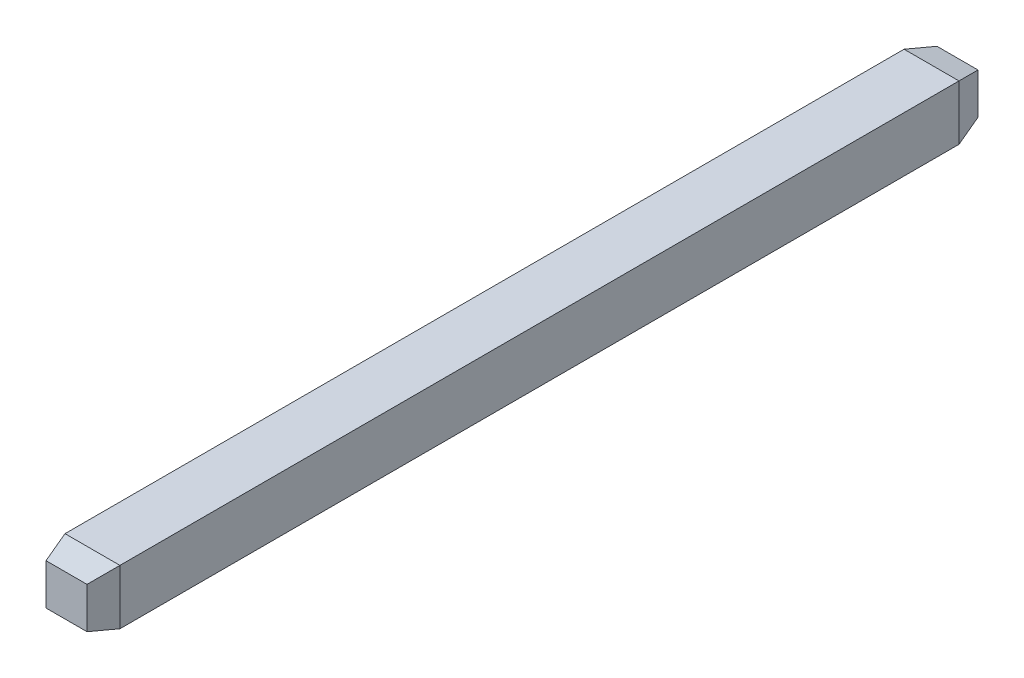
ISO-10303-21;
HEADER;
FILE_DESCRIPTION(('STEP AP214'),'2;1');
FILE_NAME('part.step','',(''),(''),'','','');
FILE_SCHEMA(('AUTOMOTIVE_DESIGN { 1 0 10303 214 1 1 1 1 }'));
ENDSEC;
DATA;
#1=APPLICATION_CONTEXT('core data for automotive mechanical design processes');
#2=APPLICATION_PROTOCOL_DEFINITION('international standard','automotive_design',2000,#1);
#3=PRODUCT_CONTEXT('',#1,'mechanical');
#4=PRODUCT('Part','Part','',(#3));
#5=PRODUCT_RELATED_PRODUCT_CATEGORY('part','',(#4));
#6=PRODUCT_DEFINITION_FORMATION('','',#4);
#7=PRODUCT_DEFINITION_CONTEXT('part definition',#1,'design');
#8=PRODUCT_DEFINITION('design','',#6,#7);
#9=PRODUCT_DEFINITION_SHAPE('','',#8);
#10=(LENGTH_UNIT() NAMED_UNIT(*) SI_UNIT(.MILLI.,.METRE.));
#11=(NAMED_UNIT(*) PLANE_ANGLE_UNIT() SI_UNIT($,.RADIAN.));
#12=(NAMED_UNIT(*) SI_UNIT($,.STERADIAN.) SOLID_ANGLE_UNIT());
#13=UNCERTAINTY_MEASURE_WITH_UNIT(LENGTH_MEASURE(1.E-05),#10,'distance_accuracy_value','');
#14=(GEOMETRIC_REPRESENTATION_CONTEXT(3) GLOBAL_UNCERTAINTY_ASSIGNED_CONTEXT((#13)) GLOBAL_UNIT_ASSIGNED_CONTEXT((#10,
#11,#12)) REPRESENTATION_CONTEXT('',''));
#15=CARTESIAN_POINT('',(0.,0.,0.));
#16=DIRECTION('',(0.,0.,1.));
#17=DIRECTION('',(1.,0.,0.));
#18=AXIS2_PLACEMENT_3D('',#15,#16,#17);
#19=CARTESIAN_POINT('',(-0.4445,-0.3175,-3.));
#20=DIRECTION('',(0.,0.965925826288944,0.258819045102985));
#21=DIRECTION('',(1.,0.,0.));
#22=AXIS2_PLACEMENT_3D('',#19,#20,#21);
#23=PLANE('',#22);
#24=DIRECTION('',(1.,0.,0.));
#25=VECTOR('',#24,1.);
#26=CARTESIAN_POINT('',(0.,-0.3175,-3.));
#27=LINE('',#26,#25);
#28=CARTESIAN_POINT('',(-0.3175,-0.3175,-3.));
#29=VERTEX_POINT('',#28);
#30=CARTESIAN_POINT('',(0.3175,-0.3175,-3.));
#31=VERTEX_POINT('',#30);
#32=EDGE_CURVE('E163',#29,#31,#27,.T.);
#33=ORIENTED_EDGE('',*,*,#32,.F.);
#34=DIRECTION('',(-0.250562807084814,-0.250562807084814,0.935113126531521));
#35=VECTOR('',#34,1.);
#36=CARTESIAN_POINT('',(-0.237115242271,-0.237115242271,-3.3));
#37=LINE('',#36,#35);
#38=CARTESIAN_POINT('',(-0.237115242271,-0.237115242271,-3.3));
#39=VERTEX_POINT('',#38);
#40=EDGE_CURVE('E11',#39,#29,#37,.T.);
#41=ORIENTED_EDGE('',*,*,#40,.F.);
#42=DIRECTION('',(1.,0.,0.));
#43=VECTOR('',#42,1.);
#44=CARTESIAN_POINT('',(0.,-0.237115242271,-3.3));
#45=LINE('',#44,#43);
#46=CARTESIAN_POINT('',(0.237115242271,-0.237115242271,-3.3));
#47=VERTEX_POINT('',#46);
#48=EDGE_CURVE('E158',#39,#47,#45,.T.);
#49=ORIENTED_EDGE('',*,*,#48,.T.);
#50=DIRECTION('',(-0.250562807084814,0.250562807084814,-0.935113126531521));
#51=VECTOR('',#50,1.);
#52=CARTESIAN_POINT('',(0.237115242271,-0.237115242271,-3.3));
#53=LINE('',#52,#51);
#54=EDGE_CURVE('E41',#31,#47,#53,.T.);
#55=ORIENTED_EDGE('',*,*,#54,.F.);
#56=EDGE_LOOP('',(#33,#41,#49,#55));
#57=FACE_BOUND('',#56,.T.);
#58=ADVANCED_FACE('F16',(#57),#23,.F.);
#59=CARTESIAN_POINT('',(-0.3175,0.4445,-3.));
#60=DIRECTION('',(0.965925826288944,0.,0.258819045102985));
#61=DIRECTION('',(0.,-1.,0.));
#62=AXIS2_PLACEMENT_3D('',#59,#60,#61);
#63=PLANE('',#62);
#64=DIRECTION('',(0.,-1.,0.));
#65=VECTOR('',#64,1.);
#66=CARTESIAN_POINT('',(-0.3175,0.,-3.));
#67=LINE('',#66,#65);
#68=CARTESIAN_POINT('',(-0.3175,0.3175,-3.));
#69=VERTEX_POINT('',#68);
#70=EDGE_CURVE('E141',#69,#29,#67,.T.);
#71=ORIENTED_EDGE('',*,*,#70,.F.);
#72=DIRECTION('',(-0.250562807084814,0.250562807084814,0.935113126531521));
#73=VECTOR('',#72,1.);
#74=CARTESIAN_POINT('',(-0.237115242271,0.237115242271,-3.3));
#75=LINE('',#74,#73);
#76=CARTESIAN_POINT('',(-0.237115242271,0.237115242271,-3.3));
#77=VERTEX_POINT('',#76);
#78=EDGE_CURVE('E27',#77,#69,#75,.T.);
#79=ORIENTED_EDGE('',*,*,#78,.F.);
#80=DIRECTION('',(0.,-1.,0.));
#81=VECTOR('',#80,1.);
#82=CARTESIAN_POINT('',(-0.237115242271,0.,-3.3));
#83=LINE('',#82,#81);
#84=EDGE_CURVE('E154',#77,#39,#83,.T.);
#85=ORIENTED_EDGE('',*,*,#84,.T.);
#86=ORIENTED_EDGE('',*,*,#40,.T.);
#87=EDGE_LOOP('',(#71,#79,#85,#86));
#88=FACE_BOUND('',#87,.T.);
#89=ADVANCED_FACE('F251',(#88),#63,.F.);
#90=CARTESIAN_POINT('',(0.4445,0.3175,-3.));
#91=DIRECTION('',(0.,-0.965925826288944,0.258819045102985));
#92=DIRECTION('',(-1.,0.,0.));
#93=AXIS2_PLACEMENT_3D('',#90,#91,#92);
#94=PLANE('',#93);
#95=DIRECTION('',(-1.,0.,0.));
#96=VECTOR('',#95,1.);
#97=CARTESIAN_POINT('',(0.,0.3175,-3.));
#98=LINE('',#97,#96);
#99=CARTESIAN_POINT('',(0.3175,0.3175,-3.));
#100=VERTEX_POINT('',#99);
#101=EDGE_CURVE('E136',#100,#69,#98,.T.);
#102=ORIENTED_EDGE('',*,*,#101,.F.);
#103=DIRECTION('',(0.250562807084814,0.250562807084814,0.935113126531521));
#104=VECTOR('',#103,1.);
#105=CARTESIAN_POINT('',(0.237115242271,0.237115242271,-3.3));
#106=LINE('',#105,#104);
#107=CARTESIAN_POINT('',(0.237115242271,0.237115242271,-3.3));
#108=VERTEX_POINT('',#107);
#109=EDGE_CURVE('E115',#108,#100,#106,.T.);
#110=ORIENTED_EDGE('',*,*,#109,.F.);
#111=DIRECTION('',(-1.,0.,0.));
#112=VECTOR('',#111,1.);
#113=CARTESIAN_POINT('',(0.,0.237115242271,-3.3));
#114=LINE('',#113,#112);
#115=EDGE_CURVE('E146',#108,#77,#114,.T.);
#116=ORIENTED_EDGE('',*,*,#115,.T.);
#117=ORIENTED_EDGE('',*,*,#78,.T.);
#118=EDGE_LOOP('',(#102,#110,#116,#117));
#119=FACE_BOUND('',#118,.T.);
#120=ADVANCED_FACE('F144',(#119),#94,.F.);
#121=CARTESIAN_POINT('',(0.3175,-0.4445,-3.));
#122=DIRECTION('',(-0.965925826288944,0.,0.258819045102985));
#123=DIRECTION('',(0.,1.,0.));
#124=AXIS2_PLACEMENT_3D('',#121,#122,#123);
#125=PLANE('',#124);
#126=DIRECTION('',(0.,1.,0.));
#127=VECTOR('',#126,1.);
#128=CARTESIAN_POINT('',(0.3175,0.,-3.));
#129=LINE('',#128,#127);
#130=EDGE_CURVE('E20',#31,#100,#129,.T.);
#131=ORIENTED_EDGE('',*,*,#130,.F.);
#132=ORIENTED_EDGE('',*,*,#54,.T.);
#133=DIRECTION('',(0.,1.,0.));
#134=VECTOR('',#133,1.);
#135=CARTESIAN_POINT('',(0.237115242271,0.,-3.3));
#136=LINE('',#135,#134);
#137=EDGE_CURVE('E120',#47,#108,#136,.T.);
#138=ORIENTED_EDGE('',*,*,#137,.T.);
#139=ORIENTED_EDGE('',*,*,#109,.T.);
#140=EDGE_LOOP('',(#131,#132,#138,#139));
#141=FACE_BOUND('',#140,.T.);
#142=ADVANCED_FACE('F117',(#141),#125,.F.);
#143=CARTESIAN_POINT('',(0.3175,0.3175,0.));
#144=DIRECTION('',(-1.,0.,0.));
#145=DIRECTION('',(0.,0.,1.));
#146=AXIS2_PLACEMENT_3D('',#143,#144,#145);
#147=PLANE('',#146);
#148=ORIENTED_EDGE('',*,*,#130,.T.);
#149=DIRECTION('',(0.,0.,1.));
#150=VECTOR('',#149,1.);
#151=CARTESIAN_POINT('',(0.3175,0.3175,1.85));
#152=LINE('',#151,#150);
#153=CARTESIAN_POINT('',(0.3175,0.3175,6.7));
#154=VERTEX_POINT('',#153);
#155=EDGE_CURVE('E128',#100,#154,#152,.T.);
#156=ORIENTED_EDGE('',*,*,#155,.T.);
#157=DIRECTION('',(0.,1.,0.));
#158=VECTOR('',#157,1.);
#159=CARTESIAN_POINT('',(0.3175,0.,6.7));
#160=LINE('',#159,#158);
#161=CARTESIAN_POINT('',(0.3175,-0.3175,6.7));
#162=VERTEX_POINT('',#161);
#163=EDGE_CURVE('E199',#162,#154,#160,.T.);
#164=ORIENTED_EDGE('',*,*,#163,.F.);
#165=DIRECTION('',(0.,0.,1.));
#166=VECTOR('',#165,1.);
#167=CARTESIAN_POINT('',(0.3175,-0.3175,1.85));
#168=LINE('',#167,#166);
#169=EDGE_CURVE('E130',#31,#162,#168,.T.);
#170=ORIENTED_EDGE('',*,*,#169,.F.);
#171=EDGE_LOOP('',(#148,#156,#164,#170));
#172=FACE_BOUND('',#171,.T.);
#173=ADVANCED_FACE('F126',(#172),#147,.F.);
#174=CARTESIAN_POINT('',(0.3175,-0.3175,0.));
#175=DIRECTION('',(0.,1.,0.));
#176=DIRECTION('',(1.,0.,0.));
#177=AXIS2_PLACEMENT_3D('',#174,#175,#176);
#178=PLANE('',#177);
#179=ORIENTED_EDGE('',*,*,#32,.T.);
#180=ORIENTED_EDGE('',*,*,#169,.T.);
#181=DIRECTION('',(1.,0.,0.));
#182=VECTOR('',#181,1.);
#183=CARTESIAN_POINT('',(0.,-0.3175,6.7));
#184=LINE('',#183,#182);
#185=CARTESIAN_POINT('',(-0.3175,-0.3175,6.7));
#186=VERTEX_POINT('',#185);
#187=EDGE_CURVE('E213',#186,#162,#184,.T.);
#188=ORIENTED_EDGE('',*,*,#187,.F.);
#189=DIRECTION('',(0.,0.,1.));
#190=VECTOR('',#189,1.);
#191=CARTESIAN_POINT('',(-0.3175,-0.3175,1.85));
#192=LINE('',#191,#190);
#193=EDGE_CURVE('E161',#29,#186,#192,.T.);
#194=ORIENTED_EDGE('',*,*,#193,.F.);
#195=EDGE_LOOP('',(#179,#180,#188,#194));
#196=FACE_BOUND('',#195,.T.);
#197=ADVANCED_FACE('F18',(#196),#178,.F.);
#198=CARTESIAN_POINT('',(-0.3175,-0.3175,0.));
#199=DIRECTION('',(1.,0.,0.));
#200=DIRECTION('',(0.,1.,0.));
#201=AXIS2_PLACEMENT_3D('',#198,#199,#200);
#202=PLANE('',#201);
#203=ORIENTED_EDGE('',*,*,#70,.T.);
#204=ORIENTED_EDGE('',*,*,#193,.T.);
#205=DIRECTION('',(0.,-1.,0.));
#206=VECTOR('',#205,1.);
#207=CARTESIAN_POINT('',(-0.3175,0.,6.7));
#208=LINE('',#207,#206);
#209=CARTESIAN_POINT('',(-0.3175,0.3175,6.7));
#210=VERTEX_POINT('',#209);
#211=EDGE_CURVE('E211',#210,#186,#208,.T.);
#212=ORIENTED_EDGE('',*,*,#211,.F.);
#213=DIRECTION('',(0.,0.,1.));
#214=VECTOR('',#213,1.);
#215=CARTESIAN_POINT('',(-0.3175,0.3175,1.85));
#216=LINE('',#215,#214);
#217=EDGE_CURVE('E142',#69,#210,#216,.T.);
#218=ORIENTED_EDGE('',*,*,#217,.F.);
#219=EDGE_LOOP('',(#203,#204,#212,#218));
#220=FACE_BOUND('',#219,.T.);
#221=ADVANCED_FACE('F246',(#220),#202,.F.);
#222=CARTESIAN_POINT('',(-0.3175,0.3175,0.));
#223=DIRECTION('',(0.,-1.,0.));
#224=DIRECTION('',(0.,0.,-1.));
#225=AXIS2_PLACEMENT_3D('',#222,#223,#224);
#226=PLANE('',#225);
#227=ORIENTED_EDGE('',*,*,#101,.T.);
#228=ORIENTED_EDGE('',*,*,#217,.T.);
#229=DIRECTION('',(-1.,0.,0.));
#230=VECTOR('',#229,1.);
#231=CARTESIAN_POINT('',(0.,0.3175,6.7));
#232=LINE('',#231,#230);
#233=EDGE_CURVE('E138',#154,#210,#232,.T.);
#234=ORIENTED_EDGE('',*,*,#233,.F.);
#235=ORIENTED_EDGE('',*,*,#155,.F.);
#236=EDGE_LOOP('',(#227,#228,#234,#235));
#237=FACE_BOUND('',#236,.T.);
#238=ADVANCED_FACE('F135',(#237),#226,.F.);
#239=CARTESIAN_POINT('',(0.,0.,-3.3));
#240=DIRECTION('',(0.,0.,1.));
#241=DIRECTION('',(1.,0.,0.));
#242=AXIS2_PLACEMENT_3D('',#239,#240,#241);
#243=PLANE('',#242);
#244=ORIENTED_EDGE('',*,*,#137,.F.);
#245=ORIENTED_EDGE('',*,*,#48,.F.);
#246=ORIENTED_EDGE('',*,*,#84,.F.);
#247=ORIENTED_EDGE('',*,*,#115,.F.);
#248=EDGE_LOOP('',(#244,#245,#246,#247));
#249=FACE_BOUND('',#248,.T.);
#250=ADVANCED_FACE('F235',(#249),#243,.F.);
#251=CARTESIAN_POINT('',(-0.4445,-0.3175,6.7));
#252=DIRECTION('',(0.,-0.965925826288944,0.258819045102985));
#253=DIRECTION('',(-1.,0.,0.));
#254=AXIS2_PLACEMENT_3D('',#251,#252,#253);
#255=PLANE('',#254);
#256=DIRECTION('',(0.250562807084813,-0.250562807084813,-0.935113126531522));
#257=VECTOR('',#256,1.);
#258=CARTESIAN_POINT('',(0.237115242271,-0.237115242271,7.));
#259=LINE('',#258,#257);
#260=CARTESIAN_POINT('',(0.237115242271,-0.237115242271,7.));
#261=VERTEX_POINT('',#260);
#262=EDGE_CURVE('E75',#261,#162,#259,.T.);
#263=ORIENTED_EDGE('',*,*,#262,.F.);
#264=DIRECTION('',(1.,0.,0.));
#265=VECTOR('',#264,1.);
#266=CARTESIAN_POINT('',(0.,-0.237115242271,7.));
#267=LINE('',#266,#265);
#268=CARTESIAN_POINT('',(-0.237115242271,-0.237115242271,7.));
#269=VERTEX_POINT('',#268);
#270=EDGE_CURVE('E176',#269,#261,#267,.T.);
#271=ORIENTED_EDGE('',*,*,#270,.F.);
#272=DIRECTION('',(0.250562807084813,0.250562807084813,0.935113126531522));
#273=VECTOR('',#272,1.);
#274=CARTESIAN_POINT('',(-0.237115242271,-0.237115242271,7.));
#275=LINE('',#274,#273);
#276=EDGE_CURVE('E91',#186,#269,#275,.T.);
#277=ORIENTED_EDGE('',*,*,#276,.F.);
#278=ORIENTED_EDGE('',*,*,#187,.T.);
#279=EDGE_LOOP('',(#263,#271,#277,#278));
#280=FACE_BOUND('',#279,.T.);
#281=ADVANCED_FACE('F237',(#280),#255,.T.);
#282=CARTESIAN_POINT('',(-0.3175,0.4445,6.7));
#283=DIRECTION('',(-0.965925826288944,0.,0.258819045102985));
#284=DIRECTION('',(0.,1.,0.));
#285=AXIS2_PLACEMENT_3D('',#282,#283,#284);
#286=PLANE('',#285);
#287=ORIENTED_EDGE('',*,*,#276,.T.);
#288=DIRECTION('',(0.,-1.,0.));
#289=VECTOR('',#288,1.);
#290=CARTESIAN_POINT('',(-0.237115242271,0.,7.));
#291=LINE('',#290,#289);
#292=CARTESIAN_POINT('',(-0.237115242271,0.237115242271,7.));
#293=VERTEX_POINT('',#292);
#294=EDGE_CURVE('E179',#293,#269,#291,.T.);
#295=ORIENTED_EDGE('',*,*,#294,.F.);
#296=DIRECTION('',(0.250562807084813,-0.250562807084813,0.935113126531522));
#297=VECTOR('',#296,1.);
#298=CARTESIAN_POINT('',(-0.237115242271,0.237115242271,7.));
#299=LINE('',#298,#297);
#300=EDGE_CURVE('E203',#210,#293,#299,.T.);
#301=ORIENTED_EDGE('',*,*,#300,.F.);
#302=ORIENTED_EDGE('',*,*,#211,.T.);
#303=EDGE_LOOP('',(#287,#295,#301,#302));
#304=FACE_BOUND('',#303,.T.);
#305=ADVANCED_FACE('F244',(#304),#286,.T.);
#306=CARTESIAN_POINT('',(0.4445,0.3175,6.7));
#307=DIRECTION('',(0.,0.965925826288944,0.258819045102985));
#308=DIRECTION('',(1.,0.,0.));
#309=AXIS2_PLACEMENT_3D('',#306,#307,#308);
#310=PLANE('',#309);
#311=ORIENTED_EDGE('',*,*,#300,.T.);
#312=DIRECTION('',(-1.,0.,0.));
#313=VECTOR('',#312,1.);
#314=CARTESIAN_POINT('',(0.,0.237115242271,7.));
#315=LINE('',#314,#313);
#316=CARTESIAN_POINT('',(0.237115242271,0.237115242271,7.));
#317=VERTEX_POINT('',#316);
#318=EDGE_CURVE('E188',#317,#293,#315,.T.);
#319=ORIENTED_EDGE('',*,*,#318,.F.);
#320=DIRECTION('',(-0.250562807084813,-0.250562807084813,0.935113126531522));
#321=VECTOR('',#320,1.);
#322=CARTESIAN_POINT('',(0.237115242271,0.237115242271,7.));
#323=LINE('',#322,#321);
#324=EDGE_CURVE('E185',#154,#317,#323,.T.);
#325=ORIENTED_EDGE('',*,*,#324,.F.);
#326=ORIENTED_EDGE('',*,*,#233,.T.);
#327=EDGE_LOOP('',(#311,#319,#325,#326));
#328=FACE_BOUND('',#327,.T.);
#329=ADVANCED_FACE('F261',(#328),#310,.T.);
#330=CARTESIAN_POINT('',(0.3175,-0.4445,6.7));
#331=DIRECTION('',(0.965925826288944,0.,0.258819045102985));
#332=DIRECTION('',(0.,-1.,0.));
#333=AXIS2_PLACEMENT_3D('',#330,#331,#332);
#334=PLANE('',#333);
#335=ORIENTED_EDGE('',*,*,#324,.T.);
#336=DIRECTION('',(0.,1.,0.));
#337=VECTOR('',#336,1.);
#338=CARTESIAN_POINT('',(0.237115242271,0.,7.));
#339=LINE('',#338,#337);
#340=EDGE_CURVE('E178',#261,#317,#339,.T.);
#341=ORIENTED_EDGE('',*,*,#340,.F.);
#342=ORIENTED_EDGE('',*,*,#262,.T.);
#343=ORIENTED_EDGE('',*,*,#163,.T.);
#344=EDGE_LOOP('',(#335,#341,#342,#343));
#345=FACE_BOUND('',#344,.T.);
#346=ADVANCED_FACE('F268',(#345),#334,.T.);
#347=CARTESIAN_POINT('',(0.,0.,7.));
#348=DIRECTION('',(0.,0.,1.));
#349=DIRECTION('',(1.,0.,0.));
#350=AXIS2_PLACEMENT_3D('',#347,#348,#349);
#351=PLANE('',#350);
#352=ORIENTED_EDGE('',*,*,#318,.T.);
#353=ORIENTED_EDGE('',*,*,#294,.T.);
#354=ORIENTED_EDGE('',*,*,#270,.T.);
#355=ORIENTED_EDGE('',*,*,#340,.T.);
#356=EDGE_LOOP('',(#352,#353,#354,#355));
#357=FACE_BOUND('',#356,.T.);
#358=ADVANCED_FACE('F340',(#357),#351,.T.);
#359=CLOSED_SHELL('',(#58,#89,#120,#142,#173,#197,#221,#238,#250,#281,#305,#329,#346,#358));
#360=MANIFOLD_SOLID_BREP('B1',#359);
#361=ADVANCED_BREP_SHAPE_REPRESENTATION('',(#18,#360),#14);
#362=SHAPE_DEFINITION_REPRESENTATION(#9,#361);
ENDSEC;
END-ISO-10303-21;
